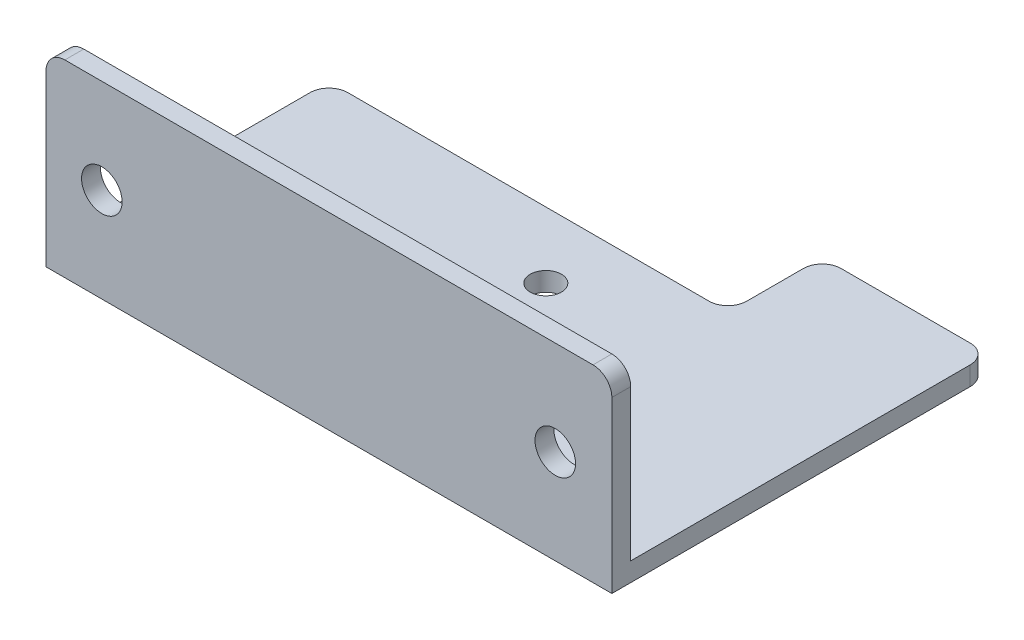
ISO-10303-21;
HEADER;
FILE_DESCRIPTION(('STEP AP214'),'2;1');
FILE_NAME('part.step','',(''),(''),'','','');
FILE_SCHEMA(('AUTOMOTIVE_DESIGN { 1 0 10303 214 1 1 1 1 }'));
ENDSEC;
DATA;
#1=APPLICATION_CONTEXT('core data for automotive mechanical design processes');
#2=APPLICATION_PROTOCOL_DEFINITION('international standard','automotive_design',2000,#1);
#3=PRODUCT_CONTEXT('',#1,'mechanical');
#4=PRODUCT('Part','Part','',(#3));
#5=PRODUCT_RELATED_PRODUCT_CATEGORY('part','',(#4));
#6=PRODUCT_DEFINITION_FORMATION('','',#4);
#7=PRODUCT_DEFINITION_CONTEXT('part definition',#1,'design');
#8=PRODUCT_DEFINITION('design','',#6,#7);
#9=PRODUCT_DEFINITION_SHAPE('','',#8);
#10=(LENGTH_UNIT() NAMED_UNIT(*) SI_UNIT(.MILLI.,.METRE.));
#11=(NAMED_UNIT(*) PLANE_ANGLE_UNIT() SI_UNIT($,.RADIAN.));
#12=(NAMED_UNIT(*) SI_UNIT($,.STERADIAN.) SOLID_ANGLE_UNIT());
#13=UNCERTAINTY_MEASURE_WITH_UNIT(LENGTH_MEASURE(1.E-05),#10,'distance_accuracy_value','');
#14=(GEOMETRIC_REPRESENTATION_CONTEXT(3) GLOBAL_UNCERTAINTY_ASSIGNED_CONTEXT((#13)) GLOBAL_UNIT_ASSIGNED_CONTEXT((#10,
#11,#12)) REPRESENTATION_CONTEXT('',''));
#15=CARTESIAN_POINT('',(0.,0.,0.));
#16=DIRECTION('',(0.,0.,1.));
#17=DIRECTION('',(1.,0.,0.));
#18=AXIS2_PLACEMENT_3D('',#15,#16,#17);
#19=CARTESIAN_POINT('',(0.,2.,0.));
#20=DIRECTION('',(0.,-1.,0.));
#21=DIRECTION('',(0.,0.,-1.));
#22=AXIS2_PLACEMENT_3D('',#19,#20,#21);
#23=PLANE('',#22);
#24=DIRECTION('',(1.,0.,0.));
#25=VECTOR('',#24,1.);
#26=CARTESIAN_POINT('',(-30.,2.,-15.));
#27=LINE('',#26,#25);
#28=CARTESIAN_POINT('',(-28.,2.,-15.));
#29=VERTEX_POINT('',#28);
#30=CARTESIAN_POINT('',(10.3047439616802,2.,-15.));
#31=VERTEX_POINT('',#30);
#32=EDGE_CURVE('E341',#29,#31,#27,.T.);
#33=ORIENTED_EDGE('',*,*,#32,.F.);
#34=CARTESIAN_POINT('',(-28.,2.,-13.));
#35=DIRECTION('',(0.,-1.,0.));
#36=DIRECTION('',(0.,0.,-1.));
#37=AXIS2_PLACEMENT_3D('',#34,#35,#36);
#38=CIRCLE('',#37,2.);
#39=CARTESIAN_POINT('',(-30.,2.,-13.));
#40=VERTEX_POINT('',#39);
#41=EDGE_CURVE('E301',#29,#40,#38,.F.);
#42=ORIENTED_EDGE('',*,*,#41,.T.);
#43=DIRECTION('',(0.,0.,-1.));
#44=VECTOR('',#43,1.);
#45=CARTESIAN_POINT('',(-30.,2.,15.));
#46=LINE('',#45,#44);
#47=CARTESIAN_POINT('',(-30.,2.,13.));
#48=VERTEX_POINT('',#47);
#49=EDGE_CURVE('E251',#48,#40,#46,.T.);
#50=ORIENTED_EDGE('',*,*,#49,.F.);
#51=DIRECTION('',(1.,0.,0.));
#52=VECTOR('',#51,1.);
#53=CARTESIAN_POINT('',(0.,2.,13.));
#54=LINE('',#53,#52);
#55=CARTESIAN_POINT('',(30.,2.,13.));
#56=VERTEX_POINT('',#55);
#57=EDGE_CURVE('E362',#48,#56,#54,.T.);
#58=ORIENTED_EDGE('',*,*,#57,.T.);
#59=DIRECTION('',(0.,0.,-1.));
#60=VECTOR('',#59,1.);
#61=CARTESIAN_POINT('',(30.,2.,15.));
#62=LINE('',#61,#60);
#63=CARTESIAN_POINT('',(30.,2.,-23.));
#64=VERTEX_POINT('',#63);
#65=EDGE_CURVE('E241',#56,#64,#62,.T.);
#66=ORIENTED_EDGE('',*,*,#65,.T.);
#67=CARTESIAN_POINT('',(28.,2.,-23.));
#68=DIRECTION('',(0.,-1.,0.));
#69=DIRECTION('',(0.,0.,-1.));
#70=AXIS2_PLACEMENT_3D('',#67,#68,#69);
#71=CIRCLE('',#70,2.);
#72=CARTESIAN_POINT('',(28.,2.,-25.));
#73=VERTEX_POINT('',#72);
#74=EDGE_CURVE('E267',#64,#73,#71,.F.);
#75=ORIENTED_EDGE('',*,*,#74,.T.);
#76=DIRECTION('',(-1.,0.,0.));
#77=VECTOR('',#76,1.);
#78=CARTESIAN_POINT('',(30.,2.,-25.));
#79=LINE('',#78,#77);
#80=CARTESIAN_POINT('',(14.3047439616802,2.,-25.));
#81=VERTEX_POINT('',#80);
#82=EDGE_CURVE('E382',#73,#81,#79,.T.);
#83=ORIENTED_EDGE('',*,*,#82,.T.);
#84=CARTESIAN_POINT('',(14.3047439616802,2.,-23.));
#85=DIRECTION('',(0.,-1.,0.));
#86=DIRECTION('',(0.,0.,-1.));
#87=AXIS2_PLACEMENT_3D('',#84,#85,#86);
#88=CIRCLE('',#87,2.);
#89=CARTESIAN_POINT('',(12.3047439616802,2.,-23.));
#90=VERTEX_POINT('',#89);
#91=EDGE_CURVE('E275',#81,#90,#88,.F.);
#92=ORIENTED_EDGE('',*,*,#91,.T.);
#93=DIRECTION('',(0.,0.,-1.));
#94=VECTOR('',#93,1.);
#95=CARTESIAN_POINT('',(12.3047439616802,2.,-15.));
#96=LINE('',#95,#94);
#97=CARTESIAN_POINT('',(12.3047439616802,2.,-17.));
#98=VERTEX_POINT('',#97);
#99=EDGE_CURVE('E386',#98,#90,#96,.T.);
#100=ORIENTED_EDGE('',*,*,#99,.F.);
#101=CARTESIAN_POINT('',(10.3047439616802,2.,-17.));
#102=DIRECTION('',(0.,-1.,0.));
#103=DIRECTION('',(0.,0.,-1.));
#104=AXIS2_PLACEMENT_3D('',#101,#102,#103);
#105=CIRCLE('',#104,2.);
#106=EDGE_CURVE('E289',#98,#31,#105,.T.);
#107=ORIENTED_EDGE('',*,*,#106,.T.);
#108=EDGE_LOOP('',(#33,#42,#50,#58,#66,#75,#83,#92,#100,#107));
#109=FACE_BOUND('',#108,.T.);
#110=CARTESIAN_POINT('',(0.,2.,8.));
#111=DIRECTION('',(0.,1.,0.));
#112=DIRECTION('',(0.,0.,1.));
#113=AXIS2_PLACEMENT_3D('',#110,#111,#112);
#114=CIRCLE('',#113,1.65);
#115=CARTESIAN_POINT('',(0.,2.,9.65));
#116=VERTEX_POINT('',#115);
#117=EDGE_CURVE('E334',#116,#116,#114,.T.);
#118=ORIENTED_EDGE('',*,*,#117,.F.);
#119=EDGE_LOOP('',(#118));
#120=FACE_BOUND('',#119,.T.);
#121=CARTESIAN_POINT('',(8.00000000000001,2.,0.));
#122=DIRECTION('',(0.,1.,0.));
#123=DIRECTION('',(0.,0.,1.));
#124=AXIS2_PLACEMENT_3D('',#121,#122,#123);
#125=CIRCLE('',#124,1.65);
#126=CARTESIAN_POINT('',(8.00000000000001,2.,1.65));
#127=VERTEX_POINT('',#126);
#128=EDGE_CURVE('E345',#127,#127,#125,.T.);
#129=ORIENTED_EDGE('',*,*,#128,.F.);
#130=EDGE_LOOP('',(#129));
#131=FACE_BOUND('',#130,.T.);
#132=CARTESIAN_POINT('',(0.,2.,-8.));
#133=DIRECTION('',(0.,1.,0.));
#134=DIRECTION('',(0.,0.,1.));
#135=AXIS2_PLACEMENT_3D('',#132,#133,#134);
#136=CIRCLE('',#135,1.65);
#137=CARTESIAN_POINT('',(0.,2.,-6.35));
#138=VERTEX_POINT('',#137);
#139=EDGE_CURVE('E350',#138,#138,#136,.T.);
#140=ORIENTED_EDGE('',*,*,#139,.F.);
#141=EDGE_LOOP('',(#140));
#142=FACE_BOUND('',#141,.T.);
#143=CARTESIAN_POINT('',(-7.99999999999999,2.,0.));
#144=DIRECTION('',(0.,1.,0.));
#145=DIRECTION('',(0.,0.,1.));
#146=AXIS2_PLACEMENT_3D('',#143,#144,#145);
#147=CIRCLE('',#146,1.65);
#148=CARTESIAN_POINT('',(-7.99999999999999,2.,1.65));
#149=VERTEX_POINT('',#148);
#150=EDGE_CURVE('E356',#149,#149,#147,.T.);
#151=ORIENTED_EDGE('',*,*,#150,.F.);
#152=EDGE_LOOP('',(#151));
#153=FACE_BOUND('',#152,.T.);
#154=ADVANCED_FACE('F129',(#109,#120,#131,#142,#153),#23,.F.);
#155=CARTESIAN_POINT('',(0.,0.,0.));
#156=DIRECTION('',(0.,-1.,0.));
#157=DIRECTION('',(0.,0.,-1.));
#158=AXIS2_PLACEMENT_3D('',#155,#156,#157);
#159=PLANE('',#158);
#160=DIRECTION('',(0.,0.,-1.));
#161=VECTOR('',#160,1.);
#162=CARTESIAN_POINT('',(-30.,0.,15.));
#163=LINE('',#162,#161);
#164=CARTESIAN_POINT('',(-30.,0.,15.));
#165=VERTEX_POINT('',#164);
#166=CARTESIAN_POINT('',(-30.,0.,-13.));
#167=VERTEX_POINT('',#166);
#168=EDGE_CURVE('E260',#165,#167,#163,.T.);
#169=ORIENTED_EDGE('',*,*,#168,.T.);
#170=CARTESIAN_POINT('',(-28.,0.,-13.));
#171=DIRECTION('',(0.,-1.,0.));
#172=DIRECTION('',(0.,0.,-1.));
#173=AXIS2_PLACEMENT_3D('',#170,#171,#172);
#174=CIRCLE('',#173,2.);
#175=CARTESIAN_POINT('',(-28.,0.,-15.));
#176=VERTEX_POINT('',#175);
#177=EDGE_CURVE('E297',#167,#176,#174,.T.);
#178=ORIENTED_EDGE('',*,*,#177,.T.);
#179=DIRECTION('',(1.,0.,0.));
#180=VECTOR('',#179,1.);
#181=CARTESIAN_POINT('',(-30.,0.,-15.));
#182=LINE('',#181,#180);
#183=CARTESIAN_POINT('',(10.3047439616802,0.,-15.));
#184=VERTEX_POINT('',#183);
#185=EDGE_CURVE('E258',#176,#184,#182,.T.);
#186=ORIENTED_EDGE('',*,*,#185,.T.);
#187=CARTESIAN_POINT('',(10.3047439616802,0.,-17.));
#188=DIRECTION('',(0.,-1.,0.));
#189=DIRECTION('',(0.,0.,-1.));
#190=AXIS2_PLACEMENT_3D('',#187,#188,#189);
#191=CIRCLE('',#190,2.);
#192=CARTESIAN_POINT('',(12.3047439616802,0.,-17.));
#193=VERTEX_POINT('',#192);
#194=EDGE_CURVE('E292',#184,#193,#191,.F.);
#195=ORIENTED_EDGE('',*,*,#194,.T.);
#196=DIRECTION('',(0.,0.,-1.));
#197=VECTOR('',#196,1.);
#198=CARTESIAN_POINT('',(12.3047439616802,0.,-15.));
#199=LINE('',#198,#197);
#200=CARTESIAN_POINT('',(12.3047439616802,0.,-23.));
#201=VERTEX_POINT('',#200);
#202=EDGE_CURVE('E385',#193,#201,#199,.T.);
#203=ORIENTED_EDGE('',*,*,#202,.T.);
#204=CARTESIAN_POINT('',(14.3047439616802,0.,-23.));
#205=DIRECTION('',(0.,-1.,0.));
#206=DIRECTION('',(0.,0.,-1.));
#207=AXIS2_PLACEMENT_3D('',#204,#205,#206);
#208=CIRCLE('',#207,2.);
#209=CARTESIAN_POINT('',(14.3047439616802,0.,-25.));
#210=VERTEX_POINT('',#209);
#211=EDGE_CURVE('E281',#201,#210,#208,.T.);
#212=ORIENTED_EDGE('',*,*,#211,.T.);
#213=DIRECTION('',(-1.,0.,0.));
#214=VECTOR('',#213,1.);
#215=CARTESIAN_POINT('',(30.,0.,-25.));
#216=LINE('',#215,#214);
#217=CARTESIAN_POINT('',(28.,0.,-25.));
#218=VERTEX_POINT('',#217);
#219=EDGE_CURVE('E379',#218,#210,#216,.T.);
#220=ORIENTED_EDGE('',*,*,#219,.F.);
#221=CARTESIAN_POINT('',(28.,0.,-23.));
#222=DIRECTION('',(0.,-1.,0.));
#223=DIRECTION('',(0.,0.,-1.));
#224=AXIS2_PLACEMENT_3D('',#221,#222,#223);
#225=CIRCLE('',#224,2.);
#226=CARTESIAN_POINT('',(30.,0.,-23.));
#227=VERTEX_POINT('',#226);
#228=EDGE_CURVE('E257',#218,#227,#225,.T.);
#229=ORIENTED_EDGE('',*,*,#228,.T.);
#230=DIRECTION('',(0.,0.,-1.));
#231=VECTOR('',#230,1.);
#232=CARTESIAN_POINT('',(30.,0.,15.));
#233=LINE('',#232,#231);
#234=CARTESIAN_POINT('',(30.,0.,15.));
#235=VERTEX_POINT('',#234);
#236=EDGE_CURVE('E236',#235,#227,#233,.T.);
#237=ORIENTED_EDGE('',*,*,#236,.F.);
#238=DIRECTION('',(1.,0.,0.));
#239=VECTOR('',#238,1.);
#240=CARTESIAN_POINT('',(-30.,0.,15.));
#241=LINE('',#240,#239);
#242=EDGE_CURVE('E244',#165,#235,#241,.T.);
#243=ORIENTED_EDGE('',*,*,#242,.F.);
#244=EDGE_LOOP('',(#169,#178,#186,#195,#203,#212,#220,#229,#237,#243));
#245=FACE_BOUND('',#244,.T.);
#246=CARTESIAN_POINT('',(0.,0.,-8.));
#247=DIRECTION('',(0.,1.,0.));
#248=DIRECTION('',(0.,0.,1.));
#249=AXIS2_PLACEMENT_3D('',#246,#247,#248);
#250=CIRCLE('',#249,1.65);
#251=CARTESIAN_POINT('',(0.,0.,-6.35));
#252=VERTEX_POINT('',#251);
#253=EDGE_CURVE('E353',#252,#252,#250,.T.);
#254=ORIENTED_EDGE('',*,*,#253,.T.);
#255=EDGE_LOOP('',(#254));
#256=FACE_BOUND('',#255,.T.);
#257=CARTESIAN_POINT('',(0.,0.,8.));
#258=DIRECTION('',(0.,1.,0.));
#259=DIRECTION('',(0.,0.,1.));
#260=AXIS2_PLACEMENT_3D('',#257,#258,#259);
#261=CIRCLE('',#260,1.65);
#262=CARTESIAN_POINT('',(0.,0.,9.65));
#263=VERTEX_POINT('',#262);
#264=EDGE_CURVE('E336',#263,#263,#261,.T.);
#265=ORIENTED_EDGE('',*,*,#264,.T.);
#266=EDGE_LOOP('',(#265));
#267=FACE_BOUND('',#266,.T.);
#268=CARTESIAN_POINT('',(8.00000000000001,0.,0.));
#269=DIRECTION('',(0.,1.,0.));
#270=DIRECTION('',(0.,0.,1.));
#271=AXIS2_PLACEMENT_3D('',#268,#269,#270);
#272=CIRCLE('',#271,1.65);
#273=CARTESIAN_POINT('',(8.00000000000001,0.,1.65));
#274=VERTEX_POINT('',#273);
#275=EDGE_CURVE('E347',#274,#274,#272,.T.);
#276=ORIENTED_EDGE('',*,*,#275,.T.);
#277=EDGE_LOOP('',(#276));
#278=FACE_BOUND('',#277,.T.);
#279=CARTESIAN_POINT('',(-7.99999999999999,0.,0.));
#280=DIRECTION('',(0.,1.,0.));
#281=DIRECTION('',(0.,0.,1.));
#282=AXIS2_PLACEMENT_3D('',#279,#280,#281);
#283=CIRCLE('',#282,1.65);
#284=CARTESIAN_POINT('',(-7.99999999999999,0.,1.65));
#285=VERTEX_POINT('',#284);
#286=EDGE_CURVE('E359',#285,#285,#283,.T.);
#287=ORIENTED_EDGE('',*,*,#286,.T.);
#288=EDGE_LOOP('',(#287));
#289=FACE_BOUND('',#288,.T.);
#290=ADVANCED_FACE('F253',(#245,#256,#267,#278,#289),#159,.T.);
#291=CARTESIAN_POINT('',(-30.,2.,15.));
#292=DIRECTION('',(-1.,0.,0.));
#293=DIRECTION('',(0.,0.,1.));
#294=AXIS2_PLACEMENT_3D('',#291,#292,#293);
#295=PLANE('',#294);
#296=DIRECTION('',(0.,-1.,0.));
#297=VECTOR('',#296,1.);
#298=CARTESIAN_POINT('',(-30.,2.,15.));
#299=LINE('',#298,#297);
#300=CARTESIAN_POINT('',(-30.,18.,15.));
#301=VERTEX_POINT('',#300);
#302=EDGE_CURVE('E240',#301,#165,#299,.T.);
#303=ORIENTED_EDGE('',*,*,#302,.F.);
#304=DIRECTION('',(0.,0.,1.));
#305=VECTOR('',#304,1.);
#306=CARTESIAN_POINT('',(-30.,18.,13.));
#307=LINE('',#306,#305);
#308=CARTESIAN_POINT('',(-30.,18.,13.));
#309=VERTEX_POINT('',#308);
#310=EDGE_CURVE('E308',#301,#309,#307,.F.);
#311=ORIENTED_EDGE('',*,*,#310,.T.);
#312=DIRECTION('',(0.,1.,0.));
#313=VECTOR('',#312,1.);
#314=CARTESIAN_POINT('',(-30.,0.,13.));
#315=LINE('',#314,#313);
#316=EDGE_CURVE('E321',#48,#309,#315,.T.);
#317=ORIENTED_EDGE('',*,*,#316,.F.);
#318=ORIENTED_EDGE('',*,*,#49,.T.);
#319=DIRECTION('',(0.,-1.,0.));
#320=VECTOR('',#319,1.);
#321=CARTESIAN_POINT('',(-30.,2.,-13.));
#322=LINE('',#321,#320);
#323=EDGE_CURVE('E294',#40,#167,#322,.T.);
#324=ORIENTED_EDGE('',*,*,#323,.T.);
#325=ORIENTED_EDGE('',*,*,#168,.F.);
#326=EDGE_LOOP('',(#303,#311,#317,#318,#324,#325));
#327=FACE_BOUND('',#326,.T.);
#328=ADVANCED_FACE('F331',(#327),#295,.T.);
#329=CARTESIAN_POINT('',(-30.,2.,15.));
#330=DIRECTION('',(0.,0.,-1.));
#331=DIRECTION('',(-1.,0.,0.));
#332=AXIS2_PLACEMENT_3D('',#329,#330,#331);
#333=PLANE('',#332);
#334=DIRECTION('',(0.,-1.,0.));
#335=VECTOR('',#334,1.);
#336=CARTESIAN_POINT('',(30.,2.,15.));
#337=LINE('',#336,#335);
#338=CARTESIAN_POINT('',(30.,18.,15.));
#339=VERTEX_POINT('',#338);
#340=EDGE_CURVE('E230',#339,#235,#337,.T.);
#341=ORIENTED_EDGE('',*,*,#340,.F.);
#342=CARTESIAN_POINT('',(28.,18.,15.));
#343=DIRECTION('',(0.,0.,-1.));
#344=DIRECTION('',(-1.,0.,0.));
#345=AXIS2_PLACEMENT_3D('',#342,#343,#344);
#346=CIRCLE('',#345,2.);
#347=CARTESIAN_POINT('',(28.,20.,15.));
#348=VERTEX_POINT('',#347);
#349=EDGE_CURVE('E151',#339,#348,#346,.F.);
#350=ORIENTED_EDGE('',*,*,#349,.T.);
#351=DIRECTION('',(1.,0.,0.));
#352=VECTOR('',#351,1.);
#353=CARTESIAN_POINT('',(-30.,20.,15.));
#354=LINE('',#353,#352);
#355=CARTESIAN_POINT('',(-28.,20.,15.));
#356=VERTEX_POINT('',#355);
#357=EDGE_CURVE('E329',#356,#348,#354,.T.);
#358=ORIENTED_EDGE('',*,*,#357,.F.);
#359=CARTESIAN_POINT('',(-28.,18.,15.));
#360=DIRECTION('',(0.,0.,-1.));
#361=DIRECTION('',(-1.,0.,0.));
#362=AXIS2_PLACEMENT_3D('',#359,#360,#361);
#363=CIRCLE('',#362,2.);
#364=EDGE_CURVE('E306',#356,#301,#363,.F.);
#365=ORIENTED_EDGE('',*,*,#364,.T.);
#366=ORIENTED_EDGE('',*,*,#302,.T.);
#367=ORIENTED_EDGE('',*,*,#242,.T.);
#368=EDGE_LOOP('',(#341,#350,#358,#365,#366,#367));
#369=FACE_BOUND('',#368,.T.);
#370=CARTESIAN_POINT('',(-24.08,10.,15.));
#371=DIRECTION('',(0.,0.,1.));
#372=DIRECTION('',(1.,0.,0.));
#373=AXIS2_PLACEMENT_3D('',#370,#371,#372);
#374=CIRCLE('',#373,2.15);
#375=CARTESIAN_POINT('',(-21.93,10.,15.));
#376=VERTEX_POINT('',#375);
#377=EDGE_CURVE('E376',#376,#376,#374,.T.);
#378=ORIENTED_EDGE('',*,*,#377,.F.);
#379=EDGE_LOOP('',(#378));
#380=FACE_BOUND('',#379,.T.);
#381=CARTESIAN_POINT('',(24.,10.,15.));
#382=DIRECTION('',(0.,0.,1.));
#383=DIRECTION('',(1.,0.,0.));
#384=AXIS2_PLACEMENT_3D('',#381,#382,#383);
#385=CIRCLE('',#384,2.15);
#386=CARTESIAN_POINT('',(26.15,10.,15.));
#387=VERTEX_POINT('',#386);
#388=EDGE_CURVE('E370',#387,#387,#385,.T.);
#389=ORIENTED_EDGE('',*,*,#388,.F.);
#390=EDGE_LOOP('',(#389));
#391=FACE_BOUND('',#390,.T.);
#392=ADVANCED_FACE('F245',(#369,#380,#391),#333,.F.);
#393=CARTESIAN_POINT('',(30.,2.,15.));
#394=DIRECTION('',(-1.,0.,0.));
#395=DIRECTION('',(0.,0.,1.));
#396=AXIS2_PLACEMENT_3D('',#393,#394,#395);
#397=PLANE('',#396);
#398=DIRECTION('',(0.,1.,0.));
#399=VECTOR('',#398,1.);
#400=CARTESIAN_POINT('',(30.,0.,13.));
#401=LINE('',#400,#399);
#402=CARTESIAN_POINT('',(30.,18.,13.));
#403=VERTEX_POINT('',#402);
#404=EDGE_CURVE('E326',#56,#403,#401,.T.);
#405=ORIENTED_EDGE('',*,*,#404,.T.);
#406=DIRECTION('',(0.,0.,1.));
#407=VECTOR('',#406,1.);
#408=CARTESIAN_POINT('',(30.,18.,15.));
#409=LINE('',#408,#407);
#410=EDGE_CURVE('E239',#403,#339,#409,.T.);
#411=ORIENTED_EDGE('',*,*,#410,.T.);
#412=ORIENTED_EDGE('',*,*,#340,.T.);
#413=ORIENTED_EDGE('',*,*,#236,.T.);
#414=DIRECTION('',(0.,1.,0.));
#415=VECTOR('',#414,1.);
#416=CARTESIAN_POINT('',(30.,2.,-23.));
#417=LINE('',#416,#415);
#418=EDGE_CURVE('E264',#227,#64,#417,.T.);
#419=ORIENTED_EDGE('',*,*,#418,.T.);
#420=ORIENTED_EDGE('',*,*,#65,.F.);
#421=EDGE_LOOP('',(#405,#411,#412,#413,#419,#420));
#422=FACE_BOUND('',#421,.T.);
#423=ADVANCED_FACE('F233',(#422),#397,.F.);
#424=CARTESIAN_POINT('',(-30.,2.,-15.));
#425=DIRECTION('',(0.,0.,-1.));
#426=DIRECTION('',(-1.,0.,0.));
#427=AXIS2_PLACEMENT_3D('',#424,#425,#426);
#428=PLANE('',#427);
#429=ORIENTED_EDGE('',*,*,#185,.F.);
#430=DIRECTION('',(0.,-1.,0.));
#431=VECTOR('',#430,1.);
#432=CARTESIAN_POINT('',(-28.,2.,-15.));
#433=LINE('',#432,#431);
#434=EDGE_CURVE('E299',#176,#29,#433,.F.);
#435=ORIENTED_EDGE('',*,*,#434,.T.);
#436=ORIENTED_EDGE('',*,*,#32,.T.);
#437=DIRECTION('',(0.,1.,0.));
#438=VECTOR('',#437,1.);
#439=CARTESIAN_POINT('',(10.3047439616802,2.,-15.));
#440=LINE('',#439,#438);
#441=EDGE_CURVE('E286',#31,#184,#440,.F.);
#442=ORIENTED_EDGE('',*,*,#441,.T.);
#443=EDGE_LOOP('',(#429,#435,#436,#442));
#444=FACE_BOUND('',#443,.T.);
#445=ADVANCED_FACE('F432',(#444),#428,.T.);
#446=CARTESIAN_POINT('',(0.,2.,8.));
#447=DIRECTION('',(0.,-1.,0.));
#448=DIRECTION('',(0.,0.,-1.));
#449=AXIS2_PLACEMENT_3D('',#446,#447,#448);
#450=CYLINDRICAL_SURFACE('',#449,1.65);
#451=ORIENTED_EDGE('',*,*,#117,.T.);
#452=EDGE_LOOP('',(#451));
#453=FACE_BOUND('',#452,.T.);
#454=ORIENTED_EDGE('',*,*,#264,.F.);
#455=EDGE_LOOP('',(#454));
#456=FACE_BOUND('',#455,.T.);
#457=ADVANCED_FACE('F425',(#453,#456),#450,.F.);
#458=CARTESIAN_POINT('',(8.00000000000001,2.,0.));
#459=DIRECTION('',(0.,-1.,0.));
#460=DIRECTION('',(0.,0.,-1.));
#461=AXIS2_PLACEMENT_3D('',#458,#459,#460);
#462=CYLINDRICAL_SURFACE('',#461,1.65);
#463=ORIENTED_EDGE('',*,*,#128,.T.);
#464=EDGE_LOOP('',(#463));
#465=FACE_BOUND('',#464,.T.);
#466=ORIENTED_EDGE('',*,*,#275,.F.);
#467=EDGE_LOOP('',(#466));
#468=FACE_BOUND('',#467,.T.);
#469=ADVANCED_FACE('F586',(#465,#468),#462,.F.);
#470=CARTESIAN_POINT('',(0.,2.,-8.));
#471=DIRECTION('',(0.,-1.,0.));
#472=DIRECTION('',(0.,0.,-1.));
#473=AXIS2_PLACEMENT_3D('',#470,#471,#472);
#474=CYLINDRICAL_SURFACE('',#473,1.65);
#475=ORIENTED_EDGE('',*,*,#139,.T.);
#476=EDGE_LOOP('',(#475));
#477=FACE_BOUND('',#476,.T.);
#478=ORIENTED_EDGE('',*,*,#253,.F.);
#479=EDGE_LOOP('',(#478));
#480=FACE_BOUND('',#479,.T.);
#481=ADVANCED_FACE('F576',(#477,#480),#474,.F.);
#482=CARTESIAN_POINT('',(-7.99999999999999,2.,0.));
#483=DIRECTION('',(0.,-1.,0.));
#484=DIRECTION('',(0.,0.,-1.));
#485=AXIS2_PLACEMENT_3D('',#482,#483,#484);
#486=CYLINDRICAL_SURFACE('',#485,1.65);
#487=ORIENTED_EDGE('',*,*,#150,.T.);
#488=EDGE_LOOP('',(#487));
#489=FACE_BOUND('',#488,.T.);
#490=ORIENTED_EDGE('',*,*,#286,.F.);
#491=EDGE_LOOP('',(#490));
#492=FACE_BOUND('',#491,.T.);
#493=ADVANCED_FACE('F491',(#489,#492),#486,.F.);
#494=CARTESIAN_POINT('',(0.,0.,13.));
#495=DIRECTION('',(0.,0.,-1.));
#496=DIRECTION('',(-1.,0.,0.));
#497=AXIS2_PLACEMENT_3D('',#494,#495,#496);
#498=PLANE('',#497);
#499=CARTESIAN_POINT('',(24.,10.,13.));
#500=DIRECTION('',(0.,0.,1.));
#501=DIRECTION('',(1.,0.,0.));
#502=AXIS2_PLACEMENT_3D('',#499,#500,#501);
#503=CIRCLE('',#502,2.15);
#504=CARTESIAN_POINT('',(26.15,10.,13.));
#505=VERTEX_POINT('',#504);
#506=EDGE_CURVE('E367',#505,#505,#503,.T.);
#507=ORIENTED_EDGE('',*,*,#506,.T.);
#508=EDGE_LOOP('',(#507));
#509=FACE_BOUND('',#508,.T.);
#510=CARTESIAN_POINT('',(-24.08,10.,13.));
#511=DIRECTION('',(0.,0.,1.));
#512=DIRECTION('',(1.,0.,0.));
#513=AXIS2_PLACEMENT_3D('',#510,#511,#512);
#514=CIRCLE('',#513,2.15);
#515=CARTESIAN_POINT('',(-21.93,10.,13.));
#516=VERTEX_POINT('',#515);
#517=EDGE_CURVE('E373',#516,#516,#514,.T.);
#518=ORIENTED_EDGE('',*,*,#517,.T.);
#519=EDGE_LOOP('',(#518));
#520=FACE_BOUND('',#519,.T.);
#521=DIRECTION('',(1.,0.,0.));
#522=VECTOR('',#521,1.);
#523=CARTESIAN_POINT('',(-30.,20.,13.));
#524=LINE('',#523,#522);
#525=CARTESIAN_POINT('',(-28.,20.,13.));
#526=VERTEX_POINT('',#525);
#527=CARTESIAN_POINT('',(28.,20.,13.));
#528=VERTEX_POINT('',#527);
#529=EDGE_CURVE('E317',#526,#528,#524,.T.);
#530=ORIENTED_EDGE('',*,*,#529,.T.);
#531=CARTESIAN_POINT('',(28.,18.,13.));
#532=DIRECTION('',(0.,0.,-1.));
#533=DIRECTION('',(-1.,0.,0.));
#534=AXIS2_PLACEMENT_3D('',#531,#532,#533);
#535=CIRCLE('',#534,2.);
#536=EDGE_CURVE('E12',#528,#403,#535,.T.);
#537=ORIENTED_EDGE('',*,*,#536,.T.);
#538=ORIENTED_EDGE('',*,*,#404,.F.);
#539=ORIENTED_EDGE('',*,*,#57,.F.);
#540=ORIENTED_EDGE('',*,*,#316,.T.);
#541=CARTESIAN_POINT('',(-28.,18.,13.));
#542=DIRECTION('',(0.,0.,-1.));
#543=DIRECTION('',(-1.,0.,0.));
#544=AXIS2_PLACEMENT_3D('',#541,#542,#543);
#545=CIRCLE('',#544,2.);
#546=EDGE_CURVE('E310',#309,#526,#545,.T.);
#547=ORIENTED_EDGE('',*,*,#546,.T.);
#548=EDGE_LOOP('',(#530,#537,#538,#539,#540,#547));
#549=FACE_BOUND('',#548,.T.);
#550=ADVANCED_FACE('F316',(#509,#520,#549),#498,.T.);
#551=CARTESIAN_POINT('',(-30.,20.,13.));
#552=DIRECTION('',(0.,-1.,0.));
#553=DIRECTION('',(0.,0.,-1.));
#554=AXIS2_PLACEMENT_3D('',#551,#552,#553);
#555=PLANE('',#554);
#556=ORIENTED_EDGE('',*,*,#357,.T.);
#557=DIRECTION('',(0.,0.,1.));
#558=VECTOR('',#557,1.);
#559=CARTESIAN_POINT('',(28.,20.,13.));
#560=LINE('',#559,#558);
#561=EDGE_CURVE('E137',#348,#528,#560,.F.);
#562=ORIENTED_EDGE('',*,*,#561,.T.);
#563=ORIENTED_EDGE('',*,*,#529,.F.);
#564=DIRECTION('',(0.,0.,1.));
#565=VECTOR('',#564,1.);
#566=CARTESIAN_POINT('',(-28.,20.,15.));
#567=LINE('',#566,#565);
#568=EDGE_CURVE('E303',#526,#356,#567,.T.);
#569=ORIENTED_EDGE('',*,*,#568,.T.);
#570=EDGE_LOOP('',(#556,#562,#563,#569));
#571=FACE_BOUND('',#570,.T.);
#572=ADVANCED_FACE('F325',(#571),#555,.F.);
#573=CARTESIAN_POINT('',(24.,10.,13.));
#574=DIRECTION('',(0.,0.,1.));
#575=DIRECTION('',(1.,0.,0.));
#576=AXIS2_PLACEMENT_3D('',#573,#574,#575);
#577=CYLINDRICAL_SURFACE('',#576,2.15);
#578=ORIENTED_EDGE('',*,*,#506,.F.);
#579=EDGE_LOOP('',(#578));
#580=FACE_BOUND('',#579,.T.);
#581=ORIENTED_EDGE('',*,*,#388,.T.);
#582=EDGE_LOOP('',(#581));
#583=FACE_BOUND('',#582,.T.);
#584=ADVANCED_FACE('F502',(#580,#583),#577,.F.);
#585=CARTESIAN_POINT('',(-24.08,10.,13.));
#586=DIRECTION('',(0.,0.,1.));
#587=DIRECTION('',(1.,0.,0.));
#588=AXIS2_PLACEMENT_3D('',#585,#586,#587);
#589=CYLINDRICAL_SURFACE('',#588,2.15);
#590=ORIENTED_EDGE('',*,*,#517,.F.);
#591=EDGE_LOOP('',(#590));
#592=FACE_BOUND('',#591,.T.);
#593=ORIENTED_EDGE('',*,*,#377,.T.);
#594=EDGE_LOOP('',(#593));
#595=FACE_BOUND('',#594,.T.);
#596=ADVANCED_FACE('F549',(#592,#595),#589,.F.);
#597=CARTESIAN_POINT('',(12.3047439616802,0.,-15.));
#598=DIRECTION('',(1.,0.,0.));
#599=DIRECTION('',(0.,0.,-1.));
#600=AXIS2_PLACEMENT_3D('',#597,#598,#599);
#601=PLANE('',#600);
#602=ORIENTED_EDGE('',*,*,#202,.F.);
#603=DIRECTION('',(0.,1.,0.));
#604=VECTOR('',#603,1.);
#605=CARTESIAN_POINT('',(12.3047439616802,0.,-17.));
#606=LINE('',#605,#604);
#607=EDGE_CURVE('E283',#193,#98,#606,.T.);
#608=ORIENTED_EDGE('',*,*,#607,.T.);
#609=ORIENTED_EDGE('',*,*,#99,.T.);
#610=DIRECTION('',(0.,1.,0.));
#611=VECTOR('',#610,1.);
#612=CARTESIAN_POINT('',(12.3047439616802,0.,-23.));
#613=LINE('',#612,#611);
#614=EDGE_CURVE('E278',#90,#201,#613,.F.);
#615=ORIENTED_EDGE('',*,*,#614,.T.);
#616=EDGE_LOOP('',(#602,#608,#609,#615));
#617=FACE_BOUND('',#616,.T.);
#618=ADVANCED_FACE('F396',(#617),#601,.F.);
#619=CARTESIAN_POINT('',(30.,0.,-25.));
#620=DIRECTION('',(0.,0.,-1.));
#621=DIRECTION('',(-1.,0.,0.));
#622=AXIS2_PLACEMENT_3D('',#619,#620,#621);
#623=PLANE('',#622);
#624=ORIENTED_EDGE('',*,*,#219,.T.);
#625=DIRECTION('',(0.,1.,0.));
#626=VECTOR('',#625,1.);
#627=CARTESIAN_POINT('',(14.3047439616802,2.,-25.));
#628=LINE('',#627,#626);
#629=EDGE_CURVE('E272',#210,#81,#628,.T.);
#630=ORIENTED_EDGE('',*,*,#629,.T.);
#631=ORIENTED_EDGE('',*,*,#82,.F.);
#632=DIRECTION('',(0.,1.,0.));
#633=VECTOR('',#632,1.);
#634=CARTESIAN_POINT('',(28.,0.,-25.));
#635=LINE('',#634,#633);
#636=EDGE_CURVE('E269',#73,#218,#635,.F.);
#637=ORIENTED_EDGE('',*,*,#636,.T.);
#638=EDGE_LOOP('',(#624,#630,#631,#637));
#639=FACE_BOUND('',#638,.T.);
#640=ADVANCED_FACE('F403',(#639),#623,.T.);
#641=CARTESIAN_POINT('',(28.,2.,-23.));
#642=DIRECTION('',(0.,-1.,0.));
#643=DIRECTION('',(0.,0.,-1.));
#644=AXIS2_PLACEMENT_3D('',#641,#642,#643);
#645=CYLINDRICAL_SURFACE('',#644,2.);
#646=ORIENTED_EDGE('',*,*,#228,.F.);
#647=ORIENTED_EDGE('',*,*,#636,.F.);
#648=ORIENTED_EDGE('',*,*,#74,.F.);
#649=ORIENTED_EDGE('',*,*,#418,.F.);
#650=EDGE_LOOP('',(#646,#647,#648,#649));
#651=FACE_BOUND('',#650,.T.);
#652=ADVANCED_FACE('F410',(#651),#645,.T.);
#653=CARTESIAN_POINT('',(14.3047439616802,0.,-23.));
#654=DIRECTION('',(0.,-1.,0.));
#655=DIRECTION('',(0.,0.,-1.));
#656=AXIS2_PLACEMENT_3D('',#653,#654,#655);
#657=CYLINDRICAL_SURFACE('',#656,2.);
#658=ORIENTED_EDGE('',*,*,#211,.F.);
#659=ORIENTED_EDGE('',*,*,#614,.F.);
#660=ORIENTED_EDGE('',*,*,#91,.F.);
#661=ORIENTED_EDGE('',*,*,#629,.F.);
#662=EDGE_LOOP('',(#658,#659,#660,#661));
#663=FACE_BOUND('',#662,.T.);
#664=ADVANCED_FACE('F400',(#663),#657,.T.);
#665=CARTESIAN_POINT('',(10.3047439616802,0.,-17.));
#666=DIRECTION('',(0.,1.,0.));
#667=DIRECTION('',(0.,0.,1.));
#668=AXIS2_PLACEMENT_3D('',#665,#666,#667);
#669=CYLINDRICAL_SURFACE('',#668,2.);
#670=ORIENTED_EDGE('',*,*,#194,.F.);
#671=ORIENTED_EDGE('',*,*,#441,.F.);
#672=ORIENTED_EDGE('',*,*,#106,.F.);
#673=ORIENTED_EDGE('',*,*,#607,.F.);
#674=EDGE_LOOP('',(#670,#671,#672,#673));
#675=FACE_BOUND('',#674,.T.);
#676=ADVANCED_FACE('F442',(#675),#669,.F.);
#677=CARTESIAN_POINT('',(-28.,2.,-13.));
#678=DIRECTION('',(0.,-1.,0.));
#679=DIRECTION('',(0.,0.,-1.));
#680=AXIS2_PLACEMENT_3D('',#677,#678,#679);
#681=CYLINDRICAL_SURFACE('',#680,2.);
#682=ORIENTED_EDGE('',*,*,#41,.F.);
#683=ORIENTED_EDGE('',*,*,#434,.F.);
#684=ORIENTED_EDGE('',*,*,#177,.F.);
#685=ORIENTED_EDGE('',*,*,#323,.F.);
#686=EDGE_LOOP('',(#682,#683,#684,#685));
#687=FACE_BOUND('',#686,.T.);
#688=ADVANCED_FACE('F417',(#687),#681,.T.);
#689=CARTESIAN_POINT('',(-28.,18.,13.));
#690=DIRECTION('',(0.,0.,-1.));
#691=DIRECTION('',(-1.,0.,0.));
#692=AXIS2_PLACEMENT_3D('',#689,#690,#691);
#693=CYLINDRICAL_SURFACE('',#692,2.);
#694=ORIENTED_EDGE('',*,*,#546,.F.);
#695=ORIENTED_EDGE('',*,*,#310,.F.);
#696=ORIENTED_EDGE('',*,*,#364,.F.);
#697=ORIENTED_EDGE('',*,*,#568,.F.);
#698=EDGE_LOOP('',(#694,#695,#696,#697));
#699=FACE_BOUND('',#698,.T.);
#700=ADVANCED_FACE('F328',(#699),#693,.T.);
#701=CARTESIAN_POINT('',(28.,18.,15.));
#702=DIRECTION('',(0.,0.,1.));
#703=DIRECTION('',(1.,0.,0.));
#704=AXIS2_PLACEMENT_3D('',#701,#702,#703);
#705=CYLINDRICAL_SURFACE('',#704,2.);
#706=ORIENTED_EDGE('',*,*,#536,.F.);
#707=ORIENTED_EDGE('',*,*,#561,.F.);
#708=ORIENTED_EDGE('',*,*,#349,.F.);
#709=ORIENTED_EDGE('',*,*,#410,.F.);
#710=EDGE_LOOP('',(#706,#707,#708,#709));
#711=FACE_BOUND('',#710,.T.);
#712=ADVANCED_FACE('F131',(#711),#705,.T.);
#713=CLOSED_SHELL('',(#154,#290,#328,#392,#423,#445,#457,#469,#481,#493,#550,#572,#584,#596,
#618,#640,#652,#664,#676,#688,#700,#712));
#714=MANIFOLD_SOLID_BREP('B2',#713);
#715=ADVANCED_BREP_SHAPE_REPRESENTATION('',(#18,#714),#14);
#716=SHAPE_DEFINITION_REPRESENTATION(#9,#715);
ENDSEC;
END-ISO-10303-21;
